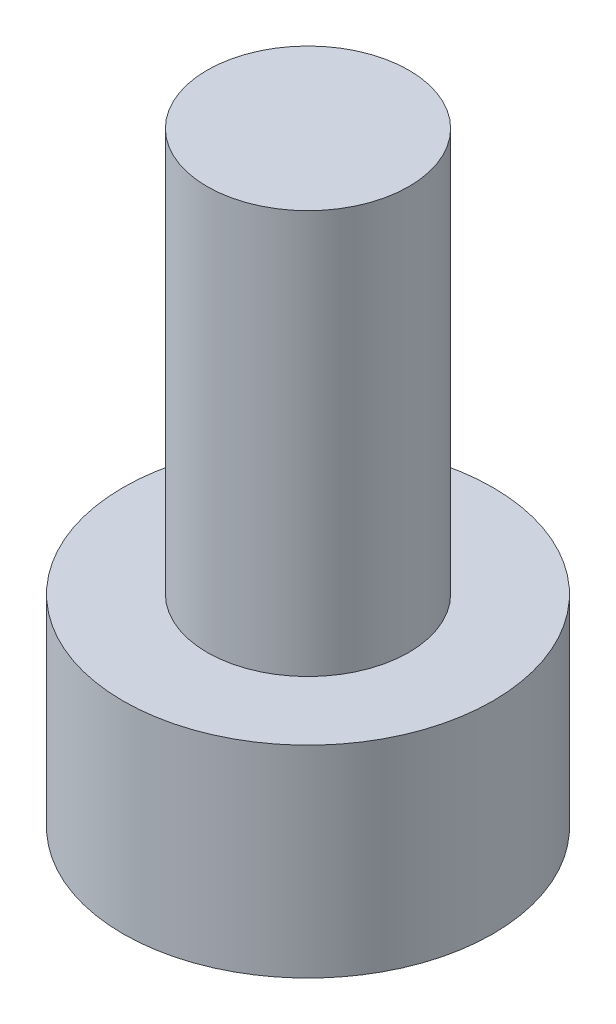
ISO-10303-21;
HEADER;
FILE_DESCRIPTION(('STEP AP214'),'2;1');
FILE_NAME('part.step','',(''),(''),'','','');
FILE_SCHEMA(('AUTOMOTIVE_DESIGN { 1 0 10303 214 1 1 1 1 }'));
ENDSEC;
DATA;
#1=APPLICATION_CONTEXT('core data for automotive mechanical design processes');
#2=APPLICATION_PROTOCOL_DEFINITION('international standard','automotive_design',2000,#1);
#3=PRODUCT_CONTEXT('',#1,'mechanical');
#4=PRODUCT('Part','Part','',(#3));
#5=PRODUCT_RELATED_PRODUCT_CATEGORY('part','',(#4));
#6=PRODUCT_DEFINITION_FORMATION('','',#4);
#7=PRODUCT_DEFINITION_CONTEXT('part definition',#1,'design');
#8=PRODUCT_DEFINITION('design','',#6,#7);
#9=PRODUCT_DEFINITION_SHAPE('','',#8);
#10=(LENGTH_UNIT() NAMED_UNIT(*) SI_UNIT(.MILLI.,.METRE.));
#11=(NAMED_UNIT(*) PLANE_ANGLE_UNIT() SI_UNIT($,.RADIAN.));
#12=(NAMED_UNIT(*) SI_UNIT($,.STERADIAN.) SOLID_ANGLE_UNIT());
#13=UNCERTAINTY_MEASURE_WITH_UNIT(LENGTH_MEASURE(1.E-05),#10,'distance_accuracy_value','');
#14=(GEOMETRIC_REPRESENTATION_CONTEXT(3) GLOBAL_UNCERTAINTY_ASSIGNED_CONTEXT((#13)) GLOBAL_UNIT_ASSIGNED_CONTEXT((#10,
#11,#12)) REPRESENTATION_CONTEXT('',''));
#15=CARTESIAN_POINT('',(0.,0.,0.));
#16=DIRECTION('',(0.,0.,1.));
#17=DIRECTION('',(1.,0.,0.));
#18=AXIS2_PLACEMENT_3D('',#15,#16,#17);
#19=CARTESIAN_POINT('',(0.,3.,0.));
#20=DIRECTION('',(0.,-1.,0.));
#21=DIRECTION('',(0.,0.,-1.));
#22=AXIS2_PLACEMENT_3D('',#19,#20,#21);
#23=CYLINDRICAL_SURFACE('',#22,2.75);
#24=CARTESIAN_POINT('',(0.,3.,0.));
#25=DIRECTION('',(0.,1.,0.));
#26=DIRECTION('',(0.,0.,1.));
#27=AXIS2_PLACEMENT_3D('',#24,#25,#26);
#28=CIRCLE('',#27,2.75);
#29=CARTESIAN_POINT('',(0.,3.,2.75));
#30=VERTEX_POINT('',#29);
#31=EDGE_CURVE('E51',#30,#30,#28,.T.);
#32=ORIENTED_EDGE('',*,*,#31,.F.);
#33=EDGE_LOOP('',(#32));
#34=FACE_BOUND('',#33,.T.);
#35=CARTESIAN_POINT('',(0.,0.,0.));
#36=DIRECTION('',(0.,1.,0.));
#37=DIRECTION('',(0.,0.,1.));
#38=AXIS2_PLACEMENT_3D('',#35,#36,#37);
#39=CIRCLE('',#38,2.75);
#40=CARTESIAN_POINT('',(0.,0.,2.75));
#41=VERTEX_POINT('',#40);
#42=EDGE_CURVE('E45',#41,#41,#39,.T.);
#43=ORIENTED_EDGE('',*,*,#42,.T.);
#44=EDGE_LOOP('',(#43));
#45=FACE_BOUND('',#44,.T.);
#46=ADVANCED_FACE('F42',(#34,#45),#23,.T.);
#47=CARTESIAN_POINT('',(0.,3.,0.));
#48=DIRECTION('',(0.,1.,0.));
#49=DIRECTION('',(0.,0.,1.));
#50=AXIS2_PLACEMENT_3D('',#47,#48,#49);
#51=PLANE('',#50);
#52=CARTESIAN_POINT('',(0.,3.,0.));
#53=DIRECTION('',(0.,1.,0.));
#54=DIRECTION('',(0.,0.,1.));
#55=AXIS2_PLACEMENT_3D('',#52,#53,#54);
#56=CIRCLE('',#55,1.5);
#57=CARTESIAN_POINT('',(0.,3.,1.5));
#58=VERTEX_POINT('',#57);
#59=EDGE_CURVE('E11',#58,#58,#56,.T.);
#60=ORIENTED_EDGE('',*,*,#59,.F.);
#61=EDGE_LOOP('',(#60));
#62=FACE_BOUND('',#61,.T.);
#63=ORIENTED_EDGE('',*,*,#31,.T.);
#64=EDGE_LOOP('',(#63));
#65=FACE_BOUND('',#64,.T.);
#66=ADVANCED_FACE('F182',(#62,#65),#51,.T.);
#67=CARTESIAN_POINT('',(0.,0.,0.));
#68=DIRECTION('',(0.,1.,0.));
#69=DIRECTION('',(0.,0.,1.));
#70=AXIS2_PLACEMENT_3D('',#67,#68,#69);
#71=PLANE('',#70);
#72=DIRECTION('',(-0.999999581919241,0.,-0.000914418581484598));
#73=VECTOR('',#72,1.);
#74=CARTESIAN_POINT('',(0.743601935905543,0.,1.2906805030361));
#75=LINE('',#74,#73);
#76=CARTESIAN_POINT('',(0.743601935905543,0.,1.2906805030361));
#77=VERTEX_POINT('',#76);
#78=CARTESIAN_POINT('',(-0.745961135845773,0.,1.28931841831554));
#79=VERTEX_POINT('',#78);
#80=EDGE_CURVE('E139',#77,#79,#75,.T.);
#81=ORIENTED_EDGE('',*,*,#80,.F.);
#82=DIRECTION('',(-0.500791700680879,0.,0.865567832425139));
#83=VECTOR('',#82,1.);
#84=CARTESIAN_POINT('',(1.48956307175132,0.,0.00136208472056382));
#85=LINE('',#84,#83);
#86=CARTESIAN_POINT('',(1.48956307175132,0.,0.00136208472056382));
#87=VERTEX_POINT('',#86);
#88=EDGE_CURVE('E59',#87,#77,#85,.T.);
#89=ORIENTED_EDGE('',*,*,#88,.F.);
#90=DIRECTION('',(0.499207881238363,0.,0.866482251006623));
#91=VECTOR('',#90,1.);
#92=CARTESIAN_POINT('',(0.745961135845773,0.,-1.28931841831554));
#93=LINE('',#92,#91);
#94=CARTESIAN_POINT('',(0.745961135845773,0.,-1.28931841831554));
#95=VERTEX_POINT('',#94);
#96=EDGE_CURVE('E152',#95,#87,#93,.T.);
#97=ORIENTED_EDGE('',*,*,#96,.F.);
#98=DIRECTION('',(0.999999581919241,0.,0.000914418581484598));
#99=VECTOR('',#98,1.);
#100=CARTESIAN_POINT('',(-0.743601935905543,0.,-1.2906805030361));
#101=LINE('',#100,#99);
#102=CARTESIAN_POINT('',(-0.743601935905543,0.,-1.2906805030361));
#103=VERTEX_POINT('',#102);
#104=EDGE_CURVE('E149',#103,#95,#101,.T.);
#105=ORIENTED_EDGE('',*,*,#104,.F.);
#106=DIRECTION('',(0.500791700680879,0.,-0.865567832425139));
#107=VECTOR('',#106,1.);
#108=CARTESIAN_POINT('',(-1.48956307175132,0.,-0.00136208472056393));
#109=LINE('',#108,#107);
#110=CARTESIAN_POINT('',(-1.48956307175132,0.,-0.00136208472056393));
#111=VERTEX_POINT('',#110);
#112=EDGE_CURVE('E107',#111,#103,#109,.T.);
#113=ORIENTED_EDGE('',*,*,#112,.F.);
#114=DIRECTION('',(-0.499207881238363,0.,-0.866482251006623));
#115=VECTOR('',#114,1.);
#116=CARTESIAN_POINT('',(-0.745961135845773,0.,1.28931841831554));
#117=LINE('',#116,#115);
#118=EDGE_CURVE('E143',#79,#111,#117,.T.);
#119=ORIENTED_EDGE('',*,*,#118,.F.);
#120=EDGE_LOOP('',(#81,#89,#97,#105,#113,#119));
#121=FACE_BOUND('',#120,.T.);
#122=ORIENTED_EDGE('',*,*,#42,.F.);
#123=EDGE_LOOP('',(#122));
#124=FACE_BOUND('',#123,.T.);
#125=ADVANCED_FACE('F179',(#121,#124),#71,.F.);
#126=CARTESIAN_POINT('',(0.,9.,0.));
#127=DIRECTION('',(0.,-1.,0.));
#128=DIRECTION('',(0.,0.,-1.));
#129=AXIS2_PLACEMENT_3D('',#126,#127,#128);
#130=CYLINDRICAL_SURFACE('',#129,1.5);
#131=CARTESIAN_POINT('',(0.,9.,0.));
#132=DIRECTION('',(0.,1.,0.));
#133=DIRECTION('',(0.,0.,1.));
#134=AXIS2_PLACEMENT_3D('',#131,#132,#133);
#135=CIRCLE('',#134,1.5);
#136=CARTESIAN_POINT('',(0.,9.,1.5));
#137=VERTEX_POINT('',#136);
#138=EDGE_CURVE('E158',#137,#137,#135,.T.);
#139=ORIENTED_EDGE('',*,*,#138,.F.);
#140=EDGE_LOOP('',(#139));
#141=FACE_BOUND('',#140,.T.);
#142=ORIENTED_EDGE('',*,*,#59,.T.);
#143=EDGE_LOOP('',(#142));
#144=FACE_BOUND('',#143,.T.);
#145=ADVANCED_FACE('F181',(#141,#144),#130,.T.);
#146=CARTESIAN_POINT('',(0.,9.,0.));
#147=DIRECTION('',(0.,1.,0.));
#148=DIRECTION('',(0.,0.,1.));
#149=AXIS2_PLACEMENT_3D('',#146,#147,#148);
#150=PLANE('',#149);
#151=ORIENTED_EDGE('',*,*,#138,.T.);
#152=EDGE_LOOP('',(#151));
#153=FACE_BOUND('',#152,.T.);
#154=ADVANCED_FACE('F188',(#153),#150,.T.);
#155=CARTESIAN_POINT('',(1.48956307175132,1.3,0.00136208472056382));
#156=DIRECTION('',(0.865567832425139,0.,0.500791700680879));
#157=DIRECTION('',(0.500791700680879,0.,-0.865567832425139));
#158=AXIS2_PLACEMENT_3D('',#155,#156,#157);
#159=PLANE('',#158);
#160=ORIENTED_EDGE('',*,*,#88,.T.);
#161=DIRECTION('',(0.,-1.,0.));
#162=VECTOR('',#161,1.);
#163=CARTESIAN_POINT('',(0.743601935905543,1.3,1.2906805030361));
#164=LINE('',#163,#162);
#165=CARTESIAN_POINT('',(0.743601935905543,1.3,1.2906805030361));
#166=VERTEX_POINT('',#165);
#167=EDGE_CURVE('E89',#166,#77,#164,.T.);
#168=ORIENTED_EDGE('',*,*,#167,.F.);
#169=DIRECTION('',(-0.500791700680879,0.,0.865567832425139));
#170=VECTOR('',#169,1.);
#171=CARTESIAN_POINT('',(1.48956307175132,1.3,0.00136208472056382));
#172=LINE('',#171,#170);
#173=CARTESIAN_POINT('',(1.48956307175132,1.3,0.00136208472056382));
#174=VERTEX_POINT('',#173);
#175=EDGE_CURVE('E155',#174,#166,#172,.T.);
#176=ORIENTED_EDGE('',*,*,#175,.F.);
#177=DIRECTION('',(0.,-1.,0.));
#178=VECTOR('',#177,1.);
#179=CARTESIAN_POINT('',(1.48956307175132,1.3,0.00136208472056382));
#180=LINE('',#179,#178);
#181=EDGE_CURVE('E67',#174,#87,#180,.T.);
#182=ORIENTED_EDGE('',*,*,#181,.T.);
#183=EDGE_LOOP('',(#160,#168,#176,#182));
#184=FACE_BOUND('',#183,.T.);
#185=ADVANCED_FACE('F219',(#184),#159,.F.);
#186=CARTESIAN_POINT('',(0.745961135845773,1.3,-1.28931841831554));
#187=DIRECTION('',(0.866482251006623,0.,-0.499207881238363));
#188=DIRECTION('',(-0.499207881238363,0.,-0.866482251006623));
#189=AXIS2_PLACEMENT_3D('',#186,#187,#188);
#190=PLANE('',#189);
#191=ORIENTED_EDGE('',*,*,#96,.T.);
#192=ORIENTED_EDGE('',*,*,#181,.F.);
#193=DIRECTION('',(0.499207881238363,0.,0.866482251006623));
#194=VECTOR('',#193,1.);
#195=CARTESIAN_POINT('',(0.745961135845773,1.3,-1.28931841831554));
#196=LINE('',#195,#194);
#197=CARTESIAN_POINT('',(0.745961135845773,1.3,-1.28931841831554));
#198=VERTEX_POINT('',#197);
#199=EDGE_CURVE('E121',#198,#174,#196,.T.);
#200=ORIENTED_EDGE('',*,*,#199,.F.);
#201=DIRECTION('',(0.,-1.,0.));
#202=VECTOR('',#201,1.);
#203=CARTESIAN_POINT('',(0.745961135845773,1.3,-1.28931841831554));
#204=LINE('',#203,#202);
#205=EDGE_CURVE('E112',#198,#95,#204,.T.);
#206=ORIENTED_EDGE('',*,*,#205,.T.);
#207=EDGE_LOOP('',(#191,#192,#200,#206));
#208=FACE_BOUND('',#207,.T.);
#209=ADVANCED_FACE('F235',(#208),#190,.F.);
#210=CARTESIAN_POINT('',(-0.743601935905543,1.3,-1.2906805030361));
#211=DIRECTION('',(0.000914418581484598,0.,-0.999999581919242));
#212=DIRECTION('',(-0.999999581919242,0.,-0.000914418581484598));
#213=AXIS2_PLACEMENT_3D('',#210,#211,#212);
#214=PLANE('',#213);
#215=ORIENTED_EDGE('',*,*,#104,.T.);
#216=ORIENTED_EDGE('',*,*,#205,.F.);
#217=DIRECTION('',(0.999999581919241,0.,0.000914418581484598));
#218=VECTOR('',#217,1.);
#219=CARTESIAN_POINT('',(-0.743601935905543,1.3,-1.2906805030361));
#220=LINE('',#219,#218);
#221=CARTESIAN_POINT('',(-0.743601935905543,1.3,-1.2906805030361));
#222=VERTEX_POINT('',#221);
#223=EDGE_CURVE('E116',#222,#198,#220,.T.);
#224=ORIENTED_EDGE('',*,*,#223,.F.);
#225=DIRECTION('',(0.,-1.,0.));
#226=VECTOR('',#225,1.);
#227=CARTESIAN_POINT('',(-0.743601935905543,1.3,-1.2906805030361));
#228=LINE('',#227,#226);
#229=EDGE_CURVE('E100',#222,#103,#228,.T.);
#230=ORIENTED_EDGE('',*,*,#229,.T.);
#231=EDGE_LOOP('',(#215,#216,#224,#230));
#232=FACE_BOUND('',#231,.T.);
#233=ADVANCED_FACE('F117',(#232),#214,.F.);
#234=CARTESIAN_POINT('',(-1.48956307175132,1.3,-0.00136208472056393));
#235=DIRECTION('',(-0.865567832425139,0.,-0.500791700680879));
#236=DIRECTION('',(-0.500791700680879,0.,0.865567832425139));
#237=AXIS2_PLACEMENT_3D('',#234,#235,#236);
#238=PLANE('',#237);
#239=ORIENTED_EDGE('',*,*,#112,.T.);
#240=ORIENTED_EDGE('',*,*,#229,.F.);
#241=DIRECTION('',(0.500791700680879,0.,-0.865567832425139));
#242=VECTOR('',#241,1.);
#243=CARTESIAN_POINT('',(-1.48956307175132,1.3,-0.00136208472056393));
#244=LINE('',#243,#242);
#245=CARTESIAN_POINT('',(-1.48956307175132,1.3,-0.00136208472056393));
#246=VERTEX_POINT('',#245);
#247=EDGE_CURVE('E104',#246,#222,#244,.T.);
#248=ORIENTED_EDGE('',*,*,#247,.F.);
#249=DIRECTION('',(0.,-1.,0.));
#250=VECTOR('',#249,1.);
#251=CARTESIAN_POINT('',(-1.48956307175132,1.3,-0.00136208472056393));
#252=LINE('',#251,#250);
#253=EDGE_CURVE('E113',#246,#111,#252,.T.);
#254=ORIENTED_EDGE('',*,*,#253,.T.);
#255=EDGE_LOOP('',(#239,#240,#248,#254));
#256=FACE_BOUND('',#255,.T.);
#257=ADVANCED_FACE('F102',(#256),#238,.F.);
#258=CARTESIAN_POINT('',(-0.745961135845773,1.3,1.28931841831554));
#259=DIRECTION('',(-0.866482251006623,0.,0.499207881238363));
#260=DIRECTION('',(0.499207881238363,0.,0.866482251006623));
#261=AXIS2_PLACEMENT_3D('',#258,#259,#260);
#262=PLANE('',#261);
#263=ORIENTED_EDGE('',*,*,#118,.T.);
#264=ORIENTED_EDGE('',*,*,#253,.F.);
#265=DIRECTION('',(-0.499207881238363,0.,-0.866482251006623));
#266=VECTOR('',#265,1.);
#267=CARTESIAN_POINT('',(-0.745961135845773,1.3,1.28931841831554));
#268=LINE('',#267,#266);
#269=CARTESIAN_POINT('',(-0.745961135845773,1.3,1.28931841831554));
#270=VERTEX_POINT('',#269);
#271=EDGE_CURVE('E127',#270,#246,#268,.T.);
#272=ORIENTED_EDGE('',*,*,#271,.F.);
#273=DIRECTION('',(0.,-1.,0.));
#274=VECTOR('',#273,1.);
#275=CARTESIAN_POINT('',(-0.745961135845773,1.3,1.28931841831554));
#276=LINE('',#275,#274);
#277=EDGE_CURVE('E163',#270,#79,#276,.T.);
#278=ORIENTED_EDGE('',*,*,#277,.T.);
#279=EDGE_LOOP('',(#263,#264,#272,#278));
#280=FACE_BOUND('',#279,.T.);
#281=ADVANCED_FACE('F263',(#280),#262,.F.);
#282=CARTESIAN_POINT('',(0.743601935905543,1.3,1.2906805030361));
#283=DIRECTION('',(-0.000914418581484598,0.,0.999999581919242));
#284=DIRECTION('',(0.999999581919242,0.,0.000914418581484598));
#285=AXIS2_PLACEMENT_3D('',#282,#283,#284);
#286=PLANE('',#285);
#287=ORIENTED_EDGE('',*,*,#80,.T.);
#288=ORIENTED_EDGE('',*,*,#277,.F.);
#289=DIRECTION('',(-0.999999581919241,0.,-0.000914418581484598));
#290=VECTOR('',#289,1.);
#291=CARTESIAN_POINT('',(0.743601935905543,1.3,1.2906805030361));
#292=LINE('',#291,#290);
#293=EDGE_CURVE('E131',#166,#270,#292,.T.);
#294=ORIENTED_EDGE('',*,*,#293,.F.);
#295=ORIENTED_EDGE('',*,*,#167,.T.);
#296=EDGE_LOOP('',(#287,#288,#294,#295));
#297=FACE_BOUND('',#296,.T.);
#298=ADVANCED_FACE('F273',(#297),#286,.F.);
#299=CARTESIAN_POINT('',(0.,1.3,0.));
#300=DIRECTION('',(0.,-1.,0.));
#301=DIRECTION('',(0.,0.,-1.));
#302=AXIS2_PLACEMENT_3D('',#299,#300,#301);
#303=PLANE('',#302);
#304=ORIENTED_EDGE('',*,*,#175,.T.);
#305=ORIENTED_EDGE('',*,*,#293,.T.);
#306=ORIENTED_EDGE('',*,*,#271,.T.);
#307=ORIENTED_EDGE('',*,*,#247,.T.);
#308=ORIENTED_EDGE('',*,*,#223,.T.);
#309=ORIENTED_EDGE('',*,*,#199,.T.);
#310=EDGE_LOOP('',(#304,#305,#306,#307,#308,#309));
#311=FACE_BOUND('',#310,.T.);
#312=ADVANCED_FACE('F124',(#311),#303,.T.);
#313=CLOSED_SHELL('',(#46,#66,#125,#145,#154,#185,#209,#233,#257,#281,#298,#312));
#314=MANIFOLD_SOLID_BREP('B2',#313);
#315=ADVANCED_BREP_SHAPE_REPRESENTATION('',(#18,#314),#14);
#316=SHAPE_DEFINITION_REPRESENTATION(#9,#315);
ENDSEC;
END-ISO-10303-21;
